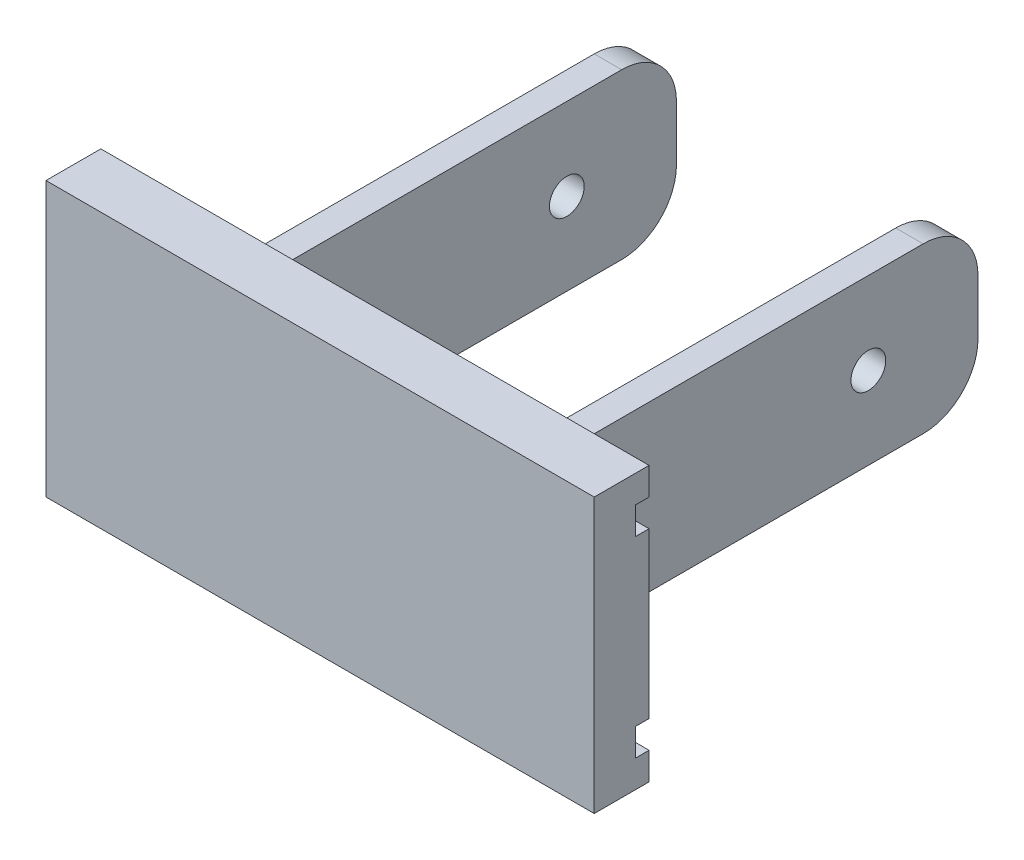
ISO-10303-21;
HEADER;
FILE_DESCRIPTION(('STEP AP214'),'2;1');
FILE_NAME('part.step','',(''),(''),'','','');
FILE_SCHEMA(('AUTOMOTIVE_DESIGN { 1 0 10303 214 1 1 1 1 }'));
ENDSEC;
DATA;
#1=APPLICATION_CONTEXT('core data for automotive mechanical design processes');
#2=APPLICATION_PROTOCOL_DEFINITION('international standard','automotive_design',2000,#1);
#3=PRODUCT_CONTEXT('',#1,'mechanical');
#4=PRODUCT('Part','Part','',(#3));
#5=PRODUCT_RELATED_PRODUCT_CATEGORY('part','',(#4));
#6=PRODUCT_DEFINITION_FORMATION('','',#4);
#7=PRODUCT_DEFINITION_CONTEXT('part definition',#1,'design');
#8=PRODUCT_DEFINITION('design','',#6,#7);
#9=PRODUCT_DEFINITION_SHAPE('','',#8);
#10=(LENGTH_UNIT() NAMED_UNIT(*) SI_UNIT(.MILLI.,.METRE.));
#11=(NAMED_UNIT(*) PLANE_ANGLE_UNIT() SI_UNIT($,.RADIAN.));
#12=(NAMED_UNIT(*) SI_UNIT($,.STERADIAN.) SOLID_ANGLE_UNIT());
#13=UNCERTAINTY_MEASURE_WITH_UNIT(LENGTH_MEASURE(1.E-05),#10,'distance_accuracy_value','');
#14=(GEOMETRIC_REPRESENTATION_CONTEXT(3) GLOBAL_UNCERTAINTY_ASSIGNED_CONTEXT((#13)) GLOBAL_UNIT_ASSIGNED_CONTEXT((#10,
#11,#12)) REPRESENTATION_CONTEXT('',''));
#15=CARTESIAN_POINT('',(0.,0.,0.));
#16=DIRECTION('',(0.,0.,1.));
#17=DIRECTION('',(1.,0.,0.));
#18=AXIS2_PLACEMENT_3D('',#15,#16,#17);
#19=CARTESIAN_POINT('',(0.,0.,0.));
#20=DIRECTION('',(0.,0.,-1.));
#21=DIRECTION('',(-1.,0.,0.));
#22=AXIS2_PLACEMENT_3D('',#19,#20,#21);
#23=PLANE('',#22);
#24=DIRECTION('',(-1.,0.,0.));
#25=VECTOR('',#24,1.);
#26=CARTESIAN_POINT('',(100.,40.,0.));
#27=LINE('',#26,#25);
#28=CARTESIAN_POINT('',(10.,40.,0.));
#29=VERTEX_POINT('',#28);
#30=CARTESIAN_POINT('',(0.,40.,0.));
#31=VERTEX_POINT('',#30);
#32=EDGE_CURVE('E482',#29,#31,#27,.T.);
#33=ORIENTED_EDGE('',*,*,#32,.F.);
#34=DIRECTION('',(0.,1.,0.));
#35=VECTOR('',#34,1.);
#36=CARTESIAN_POINT('',(9.99999999999999,0.,0.));
#37=LINE('',#36,#35);
#38=CARTESIAN_POINT('',(9.99999999999999,10.,0.));
#39=VERTEX_POINT('',#38);
#40=EDGE_CURVE('E62',#29,#39,#37,.F.);
#41=ORIENTED_EDGE('',*,*,#40,.T.);
#42=DIRECTION('',(-1.,0.,0.));
#43=VECTOR('',#42,1.);
#44=CARTESIAN_POINT('',(100.,10.,0.));
#45=LINE('',#44,#43);
#46=CARTESIAN_POINT('',(0.,10.,0.));
#47=VERTEX_POINT('',#46);
#48=EDGE_CURVE('E265',#39,#47,#45,.T.);
#49=ORIENTED_EDGE('',*,*,#48,.T.);
#50=DIRECTION('',(0.,-1.,0.));
#51=VECTOR('',#50,1.);
#52=CARTESIAN_POINT('',(0.,0.,0.));
#53=LINE('',#52,#51);
#54=EDGE_CURVE('E327',#31,#47,#53,.T.);
#55=ORIENTED_EDGE('',*,*,#54,.F.);
#56=EDGE_LOOP('',(#33,#41,#49,#55));
#57=FACE_BOUND('',#56,.T.);
#58=ADVANCED_FACE('F47',(#57),#23,.T.);
#59=CARTESIAN_POINT('',(75.,10.,0.));
#60=VERTEX_POINT('',#59);
#61=CARTESIAN_POINT('',(25.,10.,0.));
#62=VERTEX_POINT('',#61);
#63=EDGE_CURVE('E241',#60,#62,#45,.T.);
#64=ORIENTED_EDGE('',*,*,#63,.T.);
#65=DIRECTION('',(0.,-1.,0.));
#66=VECTOR('',#65,1.);
#67=CARTESIAN_POINT('',(25.,10.,0.));
#68=LINE('',#67,#66);
#69=CARTESIAN_POINT('',(25.,40.,0.));
#70=VERTEX_POINT('',#69);
#71=EDGE_CURVE('E251',#70,#62,#68,.T.);
#72=ORIENTED_EDGE('',*,*,#71,.F.);
#73=CARTESIAN_POINT('',(75.,40.,0.));
#74=VERTEX_POINT('',#73);
#75=EDGE_CURVE('E481',#74,#70,#27,.T.);
#76=ORIENTED_EDGE('',*,*,#75,.F.);
#77=DIRECTION('',(0.,1.,0.));
#78=VECTOR('',#77,1.);
#79=CARTESIAN_POINT('',(75.,10.,0.));
#80=LINE('',#79,#78);
#81=EDGE_CURVE('E257',#60,#74,#80,.T.);
#82=ORIENTED_EDGE('',*,*,#81,.F.);
#83=EDGE_LOOP('',(#64,#72,#76,#82));
#84=FACE_BOUND('',#83,.T.);
#85=ADVANCED_FACE('F261',(#84),#23,.T.);
#86=CARTESIAN_POINT('',(100.,10.,0.));
#87=VERTEX_POINT('',#86);
#88=CARTESIAN_POINT('',(90.,10.,0.));
#89=VERTEX_POINT('',#88);
#90=EDGE_CURVE('E264',#87,#89,#45,.T.);
#91=ORIENTED_EDGE('',*,*,#90,.T.);
#92=DIRECTION('',(0.,-1.,0.));
#93=VECTOR('',#92,1.);
#94=CARTESIAN_POINT('',(90.,0.,0.));
#95=LINE('',#94,#93);
#96=CARTESIAN_POINT('',(90.,40.,0.));
#97=VERTEX_POINT('',#96);
#98=EDGE_CURVE('E396',#89,#97,#95,.F.);
#99=ORIENTED_EDGE('',*,*,#98,.T.);
#100=CARTESIAN_POINT('',(100.,40.,0.));
#101=VERTEX_POINT('',#100);
#102=EDGE_CURVE('E416',#101,#97,#27,.T.);
#103=ORIENTED_EDGE('',*,*,#102,.F.);
#104=DIRECTION('',(0.,1.,0.));
#105=VECTOR('',#104,1.);
#106=CARTESIAN_POINT('',(100.,0.,0.));
#107=LINE('',#106,#105);
#108=EDGE_CURVE('E334',#87,#101,#107,.T.);
#109=ORIENTED_EDGE('',*,*,#108,.F.);
#110=EDGE_LOOP('',(#91,#99,#103,#109));
#111=FACE_BOUND('',#110,.T.);
#112=ADVANCED_FACE('F432',(#111),#23,.T.);
#113=DIRECTION('',(-1.,0.,0.));
#114=VECTOR('',#113,1.);
#115=CARTESIAN_POINT('',(100.,45.,0.));
#116=LINE('',#115,#114);
#117=CARTESIAN_POINT('',(100.,45.,0.));
#118=VERTEX_POINT('',#117);
#119=CARTESIAN_POINT('',(0.,45.,0.));
#120=VERTEX_POINT('',#119);
#121=EDGE_CURVE('E294',#118,#120,#116,.T.);
#122=ORIENTED_EDGE('',*,*,#121,.T.);
#123=CARTESIAN_POINT('',(0.,50.,0.));
#124=VERTEX_POINT('',#123);
#125=EDGE_CURVE('E323',#124,#120,#53,.T.);
#126=ORIENTED_EDGE('',*,*,#125,.F.);
#127=DIRECTION('',(-1.,0.,0.));
#128=VECTOR('',#127,1.);
#129=CARTESIAN_POINT('',(0.,50.,0.));
#130=LINE('',#129,#128);
#131=CARTESIAN_POINT('',(100.,50.,0.));
#132=VERTEX_POINT('',#131);
#133=EDGE_CURVE('E314',#132,#124,#130,.T.);
#134=ORIENTED_EDGE('',*,*,#133,.F.);
#135=EDGE_CURVE('E329',#118,#132,#107,.T.);
#136=ORIENTED_EDGE('',*,*,#135,.F.);
#137=EDGE_LOOP('',(#122,#126,#134,#136));
#138=FACE_BOUND('',#137,.T.);
#139=ADVANCED_FACE('F456',(#138),#23,.T.);
#140=CARTESIAN_POINT('',(0.,0.,10.));
#141=DIRECTION('',(1.,0.,0.));
#142=DIRECTION('',(0.,0.,-1.));
#143=AXIS2_PLACEMENT_3D('',#140,#141,#142);
#144=PLANE('',#143);
#145=ORIENTED_EDGE('',*,*,#125,.T.);
#146=DIRECTION('',(0.,0.,1.));
#147=VECTOR('',#146,1.);
#148=CARTESIAN_POINT('',(0.,45.,10.));
#149=LINE('',#148,#147);
#150=CARTESIAN_POINT('',(0.,45.,2.5));
#151=VERTEX_POINT('',#150);
#152=EDGE_CURVE('E300',#120,#151,#149,.T.);
#153=ORIENTED_EDGE('',*,*,#152,.T.);
#154=DIRECTION('',(0.,-1.,0.));
#155=VECTOR('',#154,1.);
#156=CARTESIAN_POINT('',(0.,0.,2.5));
#157=LINE('',#156,#155);
#158=CARTESIAN_POINT('',(0.,40.,2.5));
#159=VERTEX_POINT('',#158);
#160=EDGE_CURVE('E306',#151,#159,#157,.T.);
#161=ORIENTED_EDGE('',*,*,#160,.T.);
#162=DIRECTION('',(0.,0.,-1.));
#163=VECTOR('',#162,1.);
#164=CARTESIAN_POINT('',(0.,40.,10.));
#165=LINE('',#164,#163);
#166=EDGE_CURVE('E297',#159,#31,#165,.T.);
#167=ORIENTED_EDGE('',*,*,#166,.T.);
#168=ORIENTED_EDGE('',*,*,#54,.T.);
#169=DIRECTION('',(0.,0.,1.));
#170=VECTOR('',#169,1.);
#171=CARTESIAN_POINT('',(0.,9.99999999999999,10.));
#172=LINE('',#171,#170);
#173=CARTESIAN_POINT('',(0.,10.,2.5));
#174=VERTEX_POINT('',#173);
#175=EDGE_CURVE('E293',#47,#174,#172,.T.);
#176=ORIENTED_EDGE('',*,*,#175,.T.);
#177=DIRECTION('',(0.,-1.,0.));
#178=VECTOR('',#177,1.);
#179=CARTESIAN_POINT('',(0.,0.,2.5));
#180=LINE('',#179,#178);
#181=CARTESIAN_POINT('',(0.,5.,2.5));
#182=VERTEX_POINT('',#181);
#183=EDGE_CURVE('E303',#174,#182,#180,.T.);
#184=ORIENTED_EDGE('',*,*,#183,.T.);
#185=DIRECTION('',(0.,0.,-1.));
#186=VECTOR('',#185,1.);
#187=CARTESIAN_POINT('',(0.,5.,10.));
#188=LINE('',#187,#186);
#189=CARTESIAN_POINT('',(0.,5.,0.));
#190=VERTEX_POINT('',#189);
#191=EDGE_CURVE('E290',#182,#190,#188,.T.);
#192=ORIENTED_EDGE('',*,*,#191,.T.);
#193=CARTESIAN_POINT('',(0.,0.,0.));
#194=VERTEX_POINT('',#193);
#195=EDGE_CURVE('E309',#190,#194,#53,.T.);
#196=ORIENTED_EDGE('',*,*,#195,.T.);
#197=DIRECTION('',(0.,0.,-1.));
#198=VECTOR('',#197,1.);
#199=CARTESIAN_POINT('',(0.,0.,10.));
#200=LINE('',#199,#198);
#201=CARTESIAN_POINT('',(0.,0.,10.));
#202=VERTEX_POINT('',#201);
#203=EDGE_CURVE('E347',#202,#194,#200,.T.);
#204=ORIENTED_EDGE('',*,*,#203,.F.);
#205=DIRECTION('',(0.,-1.,0.));
#206=VECTOR('',#205,1.);
#207=CARTESIAN_POINT('',(0.,0.,10.));
#208=LINE('',#207,#206);
#209=CARTESIAN_POINT('',(0.,50.,10.));
#210=VERTEX_POINT('',#209);
#211=EDGE_CURVE('E310',#210,#202,#208,.T.);
#212=ORIENTED_EDGE('',*,*,#211,.F.);
#213=DIRECTION('',(0.,0.,-1.));
#214=VECTOR('',#213,1.);
#215=CARTESIAN_POINT('',(0.,50.,10.));
#216=LINE('',#215,#214);
#217=EDGE_CURVE('E322',#210,#124,#216,.T.);
#218=ORIENTED_EDGE('',*,*,#217,.T.);
#219=EDGE_LOOP('',(#145,#153,#161,#167,#168,#176,#184,#192,#196,#204,#212,#218));
#220=FACE_BOUND('',#219,.T.);
#221=ADVANCED_FACE('F458',(#220),#144,.F.);
#222=CARTESIAN_POINT('',(0.,0.,10.));
#223=DIRECTION('',(0.,1.,0.));
#224=DIRECTION('',(0.,0.,1.));
#225=AXIS2_PLACEMENT_3D('',#222,#223,#224);
#226=PLANE('',#225);
#227=DIRECTION('',(1.,0.,0.));
#228=VECTOR('',#227,1.);
#229=CARTESIAN_POINT('',(0.,0.,0.));
#230=LINE('',#229,#228);
#231=CARTESIAN_POINT('',(100.,0.,0.));
#232=VERTEX_POINT('',#231);
#233=EDGE_CURVE('E326',#194,#232,#230,.T.);
#234=ORIENTED_EDGE('',*,*,#233,.T.);
#235=DIRECTION('',(0.,0.,-1.));
#236=VECTOR('',#235,1.);
#237=CARTESIAN_POINT('',(100.,0.,10.));
#238=LINE('',#237,#236);
#239=CARTESIAN_POINT('',(100.,0.,10.));
#240=VERTEX_POINT('',#239);
#241=EDGE_CURVE('E343',#240,#232,#238,.T.);
#242=ORIENTED_EDGE('',*,*,#241,.F.);
#243=DIRECTION('',(1.,0.,0.));
#244=VECTOR('',#243,1.);
#245=CARTESIAN_POINT('',(0.,0.,10.));
#246=LINE('',#245,#244);
#247=EDGE_CURVE('E313',#202,#240,#246,.T.);
#248=ORIENTED_EDGE('',*,*,#247,.F.);
#249=ORIENTED_EDGE('',*,*,#203,.T.);
#250=EDGE_LOOP('',(#234,#242,#248,#249));
#251=FACE_BOUND('',#250,.T.);
#252=ADVANCED_FACE('F575',(#251),#226,.F.);
#253=CARTESIAN_POINT('',(100.,0.,10.));
#254=DIRECTION('',(-1.,0.,0.));
#255=DIRECTION('',(0.,0.,1.));
#256=AXIS2_PLACEMENT_3D('',#253,#254,#255);
#257=PLANE('',#256);
#258=DIRECTION('',(0.,1.,0.));
#259=VECTOR('',#258,1.);
#260=CARTESIAN_POINT('',(100.,45.,2.5));
#261=LINE('',#260,#259);
#262=CARTESIAN_POINT('',(100.,40.,2.5));
#263=VERTEX_POINT('',#262);
#264=CARTESIAN_POINT('',(100.,45.,2.5));
#265=VERTEX_POINT('',#264);
#266=EDGE_CURVE('E494',#263,#265,#261,.T.);
#267=ORIENTED_EDGE('',*,*,#266,.T.);
#268=DIRECTION('',(0.,0.,-1.));
#269=VECTOR('',#268,1.);
#270=CARTESIAN_POINT('',(100.,45.,0.));
#271=LINE('',#270,#269);
#272=EDGE_CURVE('E448',#265,#118,#271,.T.);
#273=ORIENTED_EDGE('',*,*,#272,.T.);
#274=ORIENTED_EDGE('',*,*,#135,.T.);
#275=DIRECTION('',(0.,0.,-1.));
#276=VECTOR('',#275,1.);
#277=CARTESIAN_POINT('',(100.,50.,10.));
#278=LINE('',#277,#276);
#279=CARTESIAN_POINT('',(100.,50.,10.));
#280=VERTEX_POINT('',#279);
#281=EDGE_CURVE('E339',#280,#132,#278,.T.);
#282=ORIENTED_EDGE('',*,*,#281,.F.);
#283=DIRECTION('',(0.,1.,0.));
#284=VECTOR('',#283,1.);
#285=CARTESIAN_POINT('',(100.,0.,10.));
#286=LINE('',#285,#284);
#287=EDGE_CURVE('E316',#240,#280,#286,.T.);
#288=ORIENTED_EDGE('',*,*,#287,.F.);
#289=ORIENTED_EDGE('',*,*,#241,.T.);
#290=CARTESIAN_POINT('',(100.,5.,0.));
#291=VERTEX_POINT('',#290);
#292=EDGE_CURVE('E330',#232,#291,#107,.T.);
#293=ORIENTED_EDGE('',*,*,#292,.T.);
#294=DIRECTION('',(0.,0.,1.));
#295=VECTOR('',#294,1.);
#296=CARTESIAN_POINT('',(100.,5.,0.));
#297=LINE('',#296,#295);
#298=CARTESIAN_POINT('',(100.,5.,2.5));
#299=VERTEX_POINT('',#298);
#300=EDGE_CURVE('E285',#291,#299,#297,.T.);
#301=ORIENTED_EDGE('',*,*,#300,.T.);
#302=DIRECTION('',(0.,1.,0.));
#303=VECTOR('',#302,1.);
#304=CARTESIAN_POINT('',(100.,10.,2.5));
#305=LINE('',#304,#303);
#306=CARTESIAN_POINT('',(100.,10.,2.5));
#307=VERTEX_POINT('',#306);
#308=EDGE_CURVE('E280',#299,#307,#305,.T.);
#309=ORIENTED_EDGE('',*,*,#308,.T.);
#310=DIRECTION('',(0.,0.,-1.));
#311=VECTOR('',#310,1.);
#312=CARTESIAN_POINT('',(100.,10.,0.));
#313=LINE('',#312,#311);
#314=EDGE_CURVE('E276',#307,#87,#313,.T.);
#315=ORIENTED_EDGE('',*,*,#314,.T.);
#316=ORIENTED_EDGE('',*,*,#108,.T.);
#317=DIRECTION('',(0.,0.,1.));
#318=VECTOR('',#317,1.);
#319=CARTESIAN_POINT('',(100.,40.,0.));
#320=LINE('',#319,#318);
#321=EDGE_CURVE('E289',#101,#263,#320,.T.);
#322=ORIENTED_EDGE('',*,*,#321,.T.);
#323=EDGE_LOOP('',(#267,#273,#274,#282,#288,#289,#293,#301,#309,#315,#316,#322));
#324=FACE_BOUND('',#323,.T.);
#325=ADVANCED_FACE('F444',(#324),#257,.F.);
#326=CARTESIAN_POINT('',(0.,50.,10.));
#327=DIRECTION('',(0.,-1.,0.));
#328=DIRECTION('',(0.,0.,-1.));
#329=AXIS2_PLACEMENT_3D('',#326,#327,#328);
#330=PLANE('',#329);
#331=ORIENTED_EDGE('',*,*,#133,.T.);
#332=ORIENTED_EDGE('',*,*,#217,.F.);
#333=DIRECTION('',(-1.,0.,0.));
#334=VECTOR('',#333,1.);
#335=CARTESIAN_POINT('',(0.,50.,10.));
#336=LINE('',#335,#334);
#337=EDGE_CURVE('E319',#280,#210,#336,.T.);
#338=ORIENTED_EDGE('',*,*,#337,.F.);
#339=ORIENTED_EDGE('',*,*,#281,.T.);
#340=EDGE_LOOP('',(#331,#332,#338,#339));
#341=FACE_BOUND('',#340,.T.);
#342=ADVANCED_FACE('F453',(#341),#330,.F.);
#343=CARTESIAN_POINT('',(0.,0.,10.));
#344=DIRECTION('',(0.,0.,-1.));
#345=DIRECTION('',(-1.,0.,0.));
#346=AXIS2_PLACEMENT_3D('',#343,#344,#345);
#347=PLANE('',#346);
#348=ORIENTED_EDGE('',*,*,#211,.T.);
#349=ORIENTED_EDGE('',*,*,#247,.T.);
#350=ORIENTED_EDGE('',*,*,#287,.T.);
#351=ORIENTED_EDGE('',*,*,#337,.T.);
#352=EDGE_LOOP('',(#348,#349,#350,#351));
#353=FACE_BOUND('',#352,.T.);
#354=ADVANCED_FACE('F462',(#353),#347,.F.);
#355=DIRECTION('',(-1.,0.,0.));
#356=VECTOR('',#355,1.);
#357=CARTESIAN_POINT('',(100.,5.,0.));
#358=LINE('',#357,#356);
#359=EDGE_CURVE('E281',#291,#190,#358,.T.);
#360=ORIENTED_EDGE('',*,*,#359,.F.);
#361=ORIENTED_EDGE('',*,*,#292,.F.);
#362=ORIENTED_EDGE('',*,*,#233,.F.);
#363=ORIENTED_EDGE('',*,*,#195,.F.);
#364=EDGE_LOOP('',(#360,#361,#362,#363));
#365=FACE_BOUND('',#364,.T.);
#366=ADVANCED_FACE('F469',(#365),#23,.T.);
#367=CARTESIAN_POINT('',(100.,10.,2.5));
#368=DIRECTION('',(0.,0.,1.));
#369=DIRECTION('',(0.,-1.,0.));
#370=AXIS2_PLACEMENT_3D('',#367,#368,#369);
#371=PLANE('',#370);
#372=DIRECTION('',(-1.,0.,0.));
#373=VECTOR('',#372,1.);
#374=CARTESIAN_POINT('',(100.,10.,2.5));
#375=LINE('',#374,#373);
#376=EDGE_CURVE('E271',#307,#174,#375,.T.);
#377=ORIENTED_EDGE('',*,*,#376,.F.);
#378=ORIENTED_EDGE('',*,*,#308,.F.);
#379=DIRECTION('',(-1.,0.,0.));
#380=VECTOR('',#379,1.);
#381=CARTESIAN_POINT('',(100.,5.,2.5));
#382=LINE('',#381,#380);
#383=EDGE_CURVE('E473',#299,#182,#382,.T.);
#384=ORIENTED_EDGE('',*,*,#383,.T.);
#385=ORIENTED_EDGE('',*,*,#183,.F.);
#386=EDGE_LOOP('',(#377,#378,#384,#385));
#387=FACE_BOUND('',#386,.T.);
#388=ADVANCED_FACE('F563',(#387),#371,.F.);
#389=CARTESIAN_POINT('',(100.,10.,0.));
#390=DIRECTION('',(0.,1.,0.));
#391=DIRECTION('',(0.,0.,1.));
#392=AXIS2_PLACEMENT_3D('',#389,#390,#391);
#393=PLANE('',#392);
#394=DIRECTION('',(0.,0.,1.));
#395=VECTOR('',#394,1.);
#396=CARTESIAN_POINT('',(20.,10.,-80.));
#397=LINE('',#396,#395);
#398=CARTESIAN_POINT('',(20.,10.,-70.));
#399=VERTEX_POINT('',#398);
#400=CARTESIAN_POINT('',(20.,10.,-9.99999999999999));
#401=VERTEX_POINT('',#400);
#402=EDGE_CURVE('E520',#399,#401,#397,.T.);
#403=ORIENTED_EDGE('',*,*,#402,.F.);
#404=DIRECTION('',(-1.,0.,0.));
#405=VECTOR('',#404,1.);
#406=CARTESIAN_POINT('',(100.,10.,-70.));
#407=LINE('',#406,#405);
#408=CARTESIAN_POINT('',(25.,10.,-70.));
#409=VERTEX_POINT('',#408);
#410=EDGE_CURVE('E243',#399,#409,#407,.F.);
#411=ORIENTED_EDGE('',*,*,#410,.T.);
#412=DIRECTION('',(0.,0.,1.));
#413=VECTOR('',#412,1.);
#414=CARTESIAN_POINT('',(25.,10.,-80.));
#415=LINE('',#414,#413);
#416=EDGE_CURVE('E235',#409,#62,#415,.T.);
#417=ORIENTED_EDGE('',*,*,#416,.T.);
#418=ORIENTED_EDGE('',*,*,#63,.F.);
#419=DIRECTION('',(0.,0.,1.));
#420=VECTOR('',#419,1.);
#421=CARTESIAN_POINT('',(75.,10.,-80.));
#422=LINE('',#421,#420);
#423=CARTESIAN_POINT('',(75.,10.,-70.));
#424=VERTEX_POINT('',#423);
#425=EDGE_CURVE('E498',#424,#60,#422,.T.);
#426=ORIENTED_EDGE('',*,*,#425,.F.);
#427=DIRECTION('',(-1.,0.,0.));
#428=VECTOR('',#427,1.);
#429=CARTESIAN_POINT('',(80.,10.,-70.));
#430=LINE('',#429,#428);
#431=CARTESIAN_POINT('',(80.,10.,-70.));
#432=VERTEX_POINT('',#431);
#433=EDGE_CURVE('E366',#424,#432,#430,.F.);
#434=ORIENTED_EDGE('',*,*,#433,.T.);
#435=DIRECTION('',(0.,0.,1.));
#436=VECTOR('',#435,1.);
#437=CARTESIAN_POINT('',(80.,10.,-80.));
#438=LINE('',#437,#436);
#439=CARTESIAN_POINT('',(80.,10.,-9.99999999999999));
#440=VERTEX_POINT('',#439);
#441=EDGE_CURVE('E426',#432,#440,#438,.T.);
#442=ORIENTED_EDGE('',*,*,#441,.T.);
#443=CARTESIAN_POINT('',(90.,10.,-9.99999999999999));
#444=DIRECTION('',(0.,1.,0.));
#445=DIRECTION('',(0.,0.,1.));
#446=AXIS2_PLACEMENT_3D('',#443,#444,#445);
#447=CIRCLE('',#446,10.);
#448=EDGE_CURVE('E403',#440,#89,#447,.T.);
#449=ORIENTED_EDGE('',*,*,#448,.T.);
#450=ORIENTED_EDGE('',*,*,#90,.F.);
#451=ORIENTED_EDGE('',*,*,#314,.F.);
#452=ORIENTED_EDGE('',*,*,#376,.T.);
#453=ORIENTED_EDGE('',*,*,#175,.F.);
#454=ORIENTED_EDGE('',*,*,#48,.F.);
#455=CARTESIAN_POINT('',(10.,10.,-9.99999999999999));
#456=DIRECTION('',(0.,1.,0.));
#457=DIRECTION('',(0.,0.,1.));
#458=AXIS2_PLACEMENT_3D('',#455,#456,#457);
#459=CIRCLE('',#458,10.);
#460=EDGE_CURVE('E11',#39,#401,#459,.T.);
#461=ORIENTED_EDGE('',*,*,#460,.T.);
#462=EDGE_LOOP('',(#403,#411,#417,#418,#426,#434,#442,#449,#450,#451,#452,#453,#454,#461));
#463=FACE_BOUND('',#462,.T.);
#464=ADVANCED_FACE('F238',(#463),#393,.F.);
#465=CARTESIAN_POINT('',(100.,5.,0.));
#466=DIRECTION('',(0.,-1.,0.));
#467=DIRECTION('',(0.,0.,-1.));
#468=AXIS2_PLACEMENT_3D('',#465,#466,#467);
#469=PLANE('',#468);
#470=ORIENTED_EDGE('',*,*,#383,.F.);
#471=ORIENTED_EDGE('',*,*,#300,.F.);
#472=ORIENTED_EDGE('',*,*,#359,.T.);
#473=ORIENTED_EDGE('',*,*,#191,.F.);
#474=EDGE_LOOP('',(#470,#471,#472,#473));
#475=FACE_BOUND('',#474,.T.);
#476=ADVANCED_FACE('F588',(#475),#469,.F.);
#477=CARTESIAN_POINT('',(100.,45.,2.5));
#478=DIRECTION('',(0.,0.,1.));
#479=DIRECTION('',(0.,-1.,0.));
#480=AXIS2_PLACEMENT_3D('',#477,#478,#479);
#481=PLANE('',#480);
#482=DIRECTION('',(-1.,0.,0.));
#483=VECTOR('',#482,1.);
#484=CARTESIAN_POINT('',(100.,45.,2.5));
#485=LINE('',#484,#483);
#486=EDGE_CURVE('E486',#265,#151,#485,.T.);
#487=ORIENTED_EDGE('',*,*,#486,.F.);
#488=ORIENTED_EDGE('',*,*,#266,.F.);
#489=DIRECTION('',(-1.,0.,0.));
#490=VECTOR('',#489,1.);
#491=CARTESIAN_POINT('',(100.,40.,2.5));
#492=LINE('',#491,#490);
#493=EDGE_CURVE('E480',#263,#159,#492,.T.);
#494=ORIENTED_EDGE('',*,*,#493,.T.);
#495=ORIENTED_EDGE('',*,*,#160,.F.);
#496=EDGE_LOOP('',(#487,#488,#494,#495));
#497=FACE_BOUND('',#496,.T.);
#498=ADVANCED_FACE('F726',(#497),#481,.F.);
#499=CARTESIAN_POINT('',(100.,45.,0.));
#500=DIRECTION('',(0.,1.,0.));
#501=DIRECTION('',(0.,0.,1.));
#502=AXIS2_PLACEMENT_3D('',#499,#500,#501);
#503=PLANE('',#502);
#504=ORIENTED_EDGE('',*,*,#121,.F.);
#505=ORIENTED_EDGE('',*,*,#272,.F.);
#506=ORIENTED_EDGE('',*,*,#486,.T.);
#507=ORIENTED_EDGE('',*,*,#152,.F.);
#508=EDGE_LOOP('',(#504,#505,#506,#507));
#509=FACE_BOUND('',#508,.T.);
#510=ADVANCED_FACE('F597',(#509),#503,.F.);
#511=CARTESIAN_POINT('',(100.,40.,0.));
#512=DIRECTION('',(0.,-1.,0.));
#513=DIRECTION('',(0.,0.,-1.));
#514=AXIS2_PLACEMENT_3D('',#511,#512,#513);
#515=PLANE('',#514);
#516=DIRECTION('',(0.,0.,1.));
#517=VECTOR('',#516,1.);
#518=CARTESIAN_POINT('',(80.,40.,-80.));
#519=LINE('',#518,#517);
#520=CARTESIAN_POINT('',(80.,40.,-70.));
#521=VERTEX_POINT('',#520);
#522=CARTESIAN_POINT('',(80.,40.,-9.99999999999999));
#523=VERTEX_POINT('',#522);
#524=EDGE_CURVE('E272',#521,#523,#519,.T.);
#525=ORIENTED_EDGE('',*,*,#524,.F.);
#526=DIRECTION('',(1.,0.,0.));
#527=VECTOR('',#526,1.);
#528=CARTESIAN_POINT('',(75.,40.,-70.));
#529=LINE('',#528,#527);
#530=CARTESIAN_POINT('',(75.,40.,-70.));
#531=VERTEX_POINT('',#530);
#532=EDGE_CURVE('E390',#521,#531,#529,.F.);
#533=ORIENTED_EDGE('',*,*,#532,.T.);
#534=DIRECTION('',(0.,0.,1.));
#535=VECTOR('',#534,1.);
#536=CARTESIAN_POINT('',(75.,40.,-80.));
#537=LINE('',#536,#535);
#538=EDGE_CURVE('E501',#531,#74,#537,.T.);
#539=ORIENTED_EDGE('',*,*,#538,.T.);
#540=ORIENTED_EDGE('',*,*,#75,.T.);
#541=DIRECTION('',(0.,0.,1.));
#542=VECTOR('',#541,1.);
#543=CARTESIAN_POINT('',(25.,40.,-80.));
#544=LINE('',#543,#542);
#545=CARTESIAN_POINT('',(25.,40.,-70.));
#546=VERTEX_POINT('',#545);
#547=EDGE_CURVE('E248',#546,#70,#544,.T.);
#548=ORIENTED_EDGE('',*,*,#547,.F.);
#549=DIRECTION('',(1.,0.,0.));
#550=VECTOR('',#549,1.);
#551=CARTESIAN_POINT('',(100.,40.,-70.));
#552=LINE('',#551,#550);
#553=CARTESIAN_POINT('',(20.,40.,-70.));
#554=VERTEX_POINT('',#553);
#555=EDGE_CURVE('E388',#546,#554,#552,.F.);
#556=ORIENTED_EDGE('',*,*,#555,.T.);
#557=DIRECTION('',(0.,0.,1.));
#558=VECTOR('',#557,1.);
#559=CARTESIAN_POINT('',(20.,40.,-80.));
#560=LINE('',#559,#558);
#561=CARTESIAN_POINT('',(20.,40.,-9.99999999999999));
#562=VERTEX_POINT('',#561);
#563=EDGE_CURVE('E517',#554,#562,#560,.T.);
#564=ORIENTED_EDGE('',*,*,#563,.T.);
#565=CARTESIAN_POINT('',(10.,40.,-9.99999999999999));
#566=DIRECTION('',(0.,-1.,0.));
#567=DIRECTION('',(0.,0.,-1.));
#568=AXIS2_PLACEMENT_3D('',#565,#566,#567);
#569=CIRCLE('',#568,10.);
#570=EDGE_CURVE('E55',#562,#29,#569,.T.);
#571=ORIENTED_EDGE('',*,*,#570,.T.);
#572=ORIENTED_EDGE('',*,*,#32,.T.);
#573=ORIENTED_EDGE('',*,*,#166,.F.);
#574=ORIENTED_EDGE('',*,*,#493,.F.);
#575=ORIENTED_EDGE('',*,*,#321,.F.);
#576=ORIENTED_EDGE('',*,*,#102,.T.);
#577=CARTESIAN_POINT('',(90.,40.,-9.99999999999999));
#578=DIRECTION('',(0.,-1.,0.));
#579=DIRECTION('',(0.,0.,-1.));
#580=AXIS2_PLACEMENT_3D('',#577,#578,#579);
#581=CIRCLE('',#580,10.);
#582=EDGE_CURVE('E406',#97,#523,#581,.T.);
#583=ORIENTED_EDGE('',*,*,#582,.T.);
#584=EDGE_LOOP('',(#525,#533,#539,#540,#548,#556,#564,#571,#572,#573,#574,#575,#576,#583));
#585=FACE_BOUND('',#584,.T.);
#586=ADVANCED_FACE('F413',(#585),#515,.F.);
#587=CARTESIAN_POINT('',(80.,40.,-80.));
#588=DIRECTION('',(-1.,0.,0.));
#589=DIRECTION('',(0.,0.,1.));
#590=AXIS2_PLACEMENT_3D('',#587,#588,#589);
#591=PLANE('',#590);
#592=CARTESIAN_POINT('',(80.,25.,-60.));
#593=DIRECTION('',(-1.,0.,0.));
#594=DIRECTION('',(0.,0.,1.));
#595=AXIS2_PLACEMENT_3D('',#592,#593,#594);
#596=CIRCLE('',#595,3.17320440207425);
#597=CARTESIAN_POINT('',(80.,25.,-56.8267955979258));
#598=VERTEX_POINT('',#597);
#599=EDGE_CURVE('E524',#598,#598,#596,.T.);
#600=ORIENTED_EDGE('',*,*,#599,.T.);
#601=EDGE_LOOP('',(#600));
#602=FACE_BOUND('',#601,.T.);
#603=ORIENTED_EDGE('',*,*,#524,.T.);
#604=DIRECTION('',(0.,-1.,0.));
#605=VECTOR('',#604,1.);
#606=CARTESIAN_POINT('',(80.,40.,-9.99999999999999));
#607=LINE('',#606,#605);
#608=EDGE_CURVE('E392',#523,#440,#607,.T.);
#609=ORIENTED_EDGE('',*,*,#608,.T.);
#610=ORIENTED_EDGE('',*,*,#441,.F.);
#611=CARTESIAN_POINT('',(80.,20.0000000000001,-70.));
#612=DIRECTION('',(-1.,0.,0.));
#613=DIRECTION('',(0.,0.,1.));
#614=AXIS2_PLACEMENT_3D('',#611,#612,#613);
#615=CIRCLE('',#614,10.);
#616=CARTESIAN_POINT('',(80.,20.0000000000001,-80.));
#617=VERTEX_POINT('',#616);
#618=EDGE_CURVE('E386',#432,#617,#615,.F.);
#619=ORIENTED_EDGE('',*,*,#618,.T.);
#620=DIRECTION('',(0.,-1.,0.));
#621=VECTOR('',#620,1.);
#622=CARTESIAN_POINT('',(80.,40.,-80.));
#623=LINE('',#622,#621);
#624=CARTESIAN_POINT('',(80.,30.,-80.));
#625=VERTEX_POINT('',#624);
#626=EDGE_CURVE('E506',#625,#617,#623,.T.);
#627=ORIENTED_EDGE('',*,*,#626,.F.);
#628=CARTESIAN_POINT('',(80.,30.,-70.));
#629=DIRECTION('',(-1.,0.,0.));
#630=DIRECTION('',(0.,0.,1.));
#631=AXIS2_PLACEMENT_3D('',#628,#629,#630);
#632=CIRCLE('',#631,10.);
#633=EDGE_CURVE('E384',#625,#521,#632,.F.);
#634=ORIENTED_EDGE('',*,*,#633,.T.);
#635=EDGE_LOOP('',(#603,#609,#610,#619,#627,#634));
#636=FACE_BOUND('',#635,.T.);
#637=ADVANCED_FACE('F421',(#602,#636),#591,.F.);
#638=CARTESIAN_POINT('',(75.,10.,-80.));
#639=DIRECTION('',(1.,0.,0.));
#640=DIRECTION('',(0.,0.,-1.));
#641=AXIS2_PLACEMENT_3D('',#638,#639,#640);
#642=PLANE('',#641);
#643=CARTESIAN_POINT('',(75.,25.,-60.));
#644=DIRECTION('',(1.,0.,0.));
#645=DIRECTION('',(0.,0.,-1.));
#646=AXIS2_PLACEMENT_3D('',#643,#644,#645);
#647=CIRCLE('',#646,3.17320440207425);
#648=CARTESIAN_POINT('',(75.,25.,-63.1732044020742));
#649=VERTEX_POINT('',#648);
#650=EDGE_CURVE('E527',#649,#649,#647,.T.);
#651=ORIENTED_EDGE('',*,*,#650,.T.);
#652=EDGE_LOOP('',(#651));
#653=FACE_BOUND('',#652,.T.);
#654=DIRECTION('',(0.,1.,0.));
#655=VECTOR('',#654,1.);
#656=CARTESIAN_POINT('',(75.,10.,-80.));
#657=LINE('',#656,#655);
#658=CARTESIAN_POINT('',(75.,20.0000000000001,-80.));
#659=VERTEX_POINT('',#658);
#660=CARTESIAN_POINT('',(75.,30.,-80.));
#661=VERTEX_POINT('',#660);
#662=EDGE_CURVE('E504',#659,#661,#657,.T.);
#663=ORIENTED_EDGE('',*,*,#662,.F.);
#664=CARTESIAN_POINT('',(75.,20.0000000000001,-70.));
#665=DIRECTION('',(1.,0.,0.));
#666=DIRECTION('',(0.,0.,-1.));
#667=AXIS2_PLACEMENT_3D('',#664,#665,#666);
#668=CIRCLE('',#667,10.);
#669=EDGE_CURVE('E382',#659,#424,#668,.F.);
#670=ORIENTED_EDGE('',*,*,#669,.T.);
#671=ORIENTED_EDGE('',*,*,#425,.T.);
#672=ORIENTED_EDGE('',*,*,#81,.T.);
#673=ORIENTED_EDGE('',*,*,#538,.F.);
#674=CARTESIAN_POINT('',(75.,30.,-70.));
#675=DIRECTION('',(1.,0.,0.));
#676=DIRECTION('',(0.,0.,-1.));
#677=AXIS2_PLACEMENT_3D('',#674,#675,#676);
#678=CIRCLE('',#677,10.);
#679=EDGE_CURVE('E380',#531,#661,#678,.F.);
#680=ORIENTED_EDGE('',*,*,#679,.T.);
#681=EDGE_LOOP('',(#663,#670,#671,#672,#673,#680));
#682=FACE_BOUND('',#681,.T.);
#683=ADVANCED_FACE('F604',(#653,#682),#642,.F.);
#684=CARTESIAN_POINT('',(0.,0.,-80.));
#685=DIRECTION('',(0.,0.,-1.));
#686=DIRECTION('',(-1.,0.,0.));
#687=AXIS2_PLACEMENT_3D('',#684,#685,#686);
#688=PLANE('',#687);
#689=ORIENTED_EDGE('',*,*,#626,.T.);
#690=DIRECTION('',(-1.,0.,0.));
#691=VECTOR('',#690,1.);
#692=CARTESIAN_POINT('',(75.,20.0000000000001,-80.));
#693=LINE('',#692,#691);
#694=EDGE_CURVE('E377',#617,#659,#693,.T.);
#695=ORIENTED_EDGE('',*,*,#694,.T.);
#696=ORIENTED_EDGE('',*,*,#662,.T.);
#697=DIRECTION('',(1.,0.,0.));
#698=VECTOR('',#697,1.);
#699=CARTESIAN_POINT('',(80.,30.,-80.));
#700=LINE('',#699,#698);
#701=EDGE_CURVE('E374',#661,#625,#700,.T.);
#702=ORIENTED_EDGE('',*,*,#701,.T.);
#703=EDGE_LOOP('',(#689,#695,#696,#702));
#704=FACE_BOUND('',#703,.T.);
#705=ADVANCED_FACE('F615',(#704),#688,.T.);
#706=CARTESIAN_POINT('',(20.,40.,-80.));
#707=DIRECTION('',(1.,0.,0.));
#708=DIRECTION('',(0.,1.,0.));
#709=AXIS2_PLACEMENT_3D('',#706,#707,#708);
#710=PLANE('',#709);
#711=CARTESIAN_POINT('',(20.,25.,-60.));
#712=DIRECTION('',(1.,0.,0.));
#713=DIRECTION('',(0.,1.,0.));
#714=AXIS2_PLACEMENT_3D('',#711,#712,#713);
#715=CIRCLE('',#714,3.17320440207425);
#716=CARTESIAN_POINT('',(20.,28.1732044020742,-60.));
#717=VERTEX_POINT('',#716);
#718=EDGE_CURVE('E355',#717,#717,#715,.T.);
#719=ORIENTED_EDGE('',*,*,#718,.T.);
#720=EDGE_LOOP('',(#719));
#721=FACE_BOUND('',#720,.T.);
#722=ORIENTED_EDGE('',*,*,#402,.T.);
#723=DIRECTION('',(0.,1.,0.));
#724=VECTOR('',#723,1.);
#725=CARTESIAN_POINT('',(20.,40.,-9.99999999999999));
#726=LINE('',#725,#724);
#727=EDGE_CURVE('E399',#401,#562,#726,.T.);
#728=ORIENTED_EDGE('',*,*,#727,.T.);
#729=ORIENTED_EDGE('',*,*,#563,.F.);
#730=CARTESIAN_POINT('',(20.,30.,-70.));
#731=DIRECTION('',(1.,0.,0.));
#732=DIRECTION('',(0.,1.,0.));
#733=AXIS2_PLACEMENT_3D('',#730,#731,#732);
#734=CIRCLE('',#733,10.);
#735=CARTESIAN_POINT('',(20.,30.,-80.));
#736=VERTEX_POINT('',#735);
#737=EDGE_CURVE('E361',#554,#736,#734,.F.);
#738=ORIENTED_EDGE('',*,*,#737,.T.);
#739=DIRECTION('',(0.,1.,0.));
#740=VECTOR('',#739,1.);
#741=CARTESIAN_POINT('',(20.,40.,-80.));
#742=LINE('',#741,#740);
#743=CARTESIAN_POINT('',(20.,20.0000000000001,-80.));
#744=VERTEX_POINT('',#743);
#745=EDGE_CURVE('E258',#744,#736,#742,.T.);
#746=ORIENTED_EDGE('',*,*,#745,.F.);
#747=CARTESIAN_POINT('',(20.,20.0000000000001,-70.));
#748=DIRECTION('',(1.,0.,0.));
#749=DIRECTION('',(0.,1.,0.));
#750=AXIS2_PLACEMENT_3D('',#747,#748,#749);
#751=CIRCLE('',#750,10.);
#752=EDGE_CURVE('E363',#744,#399,#751,.F.);
#753=ORIENTED_EDGE('',*,*,#752,.T.);
#754=EDGE_LOOP('',(#722,#728,#729,#738,#746,#753));
#755=FACE_BOUND('',#754,.T.);
#756=ADVANCED_FACE('F534',(#721,#755),#710,.F.);
#757=CARTESIAN_POINT('',(25.,10.,-80.));
#758=DIRECTION('',(-1.,0.,0.));
#759=DIRECTION('',(0.,-1.,0.));
#760=AXIS2_PLACEMENT_3D('',#757,#758,#759);
#761=PLANE('',#760);
#762=CARTESIAN_POINT('',(25.,25.,-60.));
#763=DIRECTION('',(-1.,0.,0.));
#764=DIRECTION('',(0.,-1.,0.));
#765=AXIS2_PLACEMENT_3D('',#762,#763,#764);
#766=CIRCLE('',#765,3.17320440207425);
#767=CARTESIAN_POINT('',(25.,21.8267955979258,-60.));
#768=VERTEX_POINT('',#767);
#769=EDGE_CURVE('E351',#768,#768,#766,.T.);
#770=ORIENTED_EDGE('',*,*,#769,.T.);
#771=EDGE_LOOP('',(#770));
#772=FACE_BOUND('',#771,.T.);
#773=ORIENTED_EDGE('',*,*,#416,.F.);
#774=CARTESIAN_POINT('',(25.,20.0000000000001,-70.));
#775=DIRECTION('',(-1.,0.,0.));
#776=DIRECTION('',(0.,-1.,0.));
#777=AXIS2_PLACEMENT_3D('',#774,#775,#776);
#778=CIRCLE('',#777,10.);
#779=CARTESIAN_POINT('',(25.,20.0000000000001,-80.));
#780=VERTEX_POINT('',#779);
#781=EDGE_CURVE('E372',#409,#780,#778,.F.);
#782=ORIENTED_EDGE('',*,*,#781,.T.);
#783=DIRECTION('',(0.,-1.,0.));
#784=VECTOR('',#783,1.);
#785=CARTESIAN_POINT('',(25.,10.,-80.));
#786=LINE('',#785,#784);
#787=CARTESIAN_POINT('',(25.,30.,-80.));
#788=VERTEX_POINT('',#787);
#789=EDGE_CURVE('E247',#788,#780,#786,.T.);
#790=ORIENTED_EDGE('',*,*,#789,.F.);
#791=CARTESIAN_POINT('',(25.,30.,-70.));
#792=DIRECTION('',(-1.,0.,0.));
#793=DIRECTION('',(0.,-1.,0.));
#794=AXIS2_PLACEMENT_3D('',#791,#792,#793);
#795=CIRCLE('',#794,10.);
#796=EDGE_CURVE('E370',#788,#546,#795,.F.);
#797=ORIENTED_EDGE('',*,*,#796,.T.);
#798=ORIENTED_EDGE('',*,*,#547,.T.);
#799=ORIENTED_EDGE('',*,*,#71,.T.);
#800=EDGE_LOOP('',(#773,#782,#790,#797,#798,#799));
#801=FACE_BOUND('',#800,.T.);
#802=ADVANCED_FACE('F252',(#772,#801),#761,.F.);
#803=CARTESIAN_POINT('',(0.,0.,-80.));
#804=DIRECTION('',(0.,0.,1.));
#805=DIRECTION('',(1.,0.,0.));
#806=AXIS2_PLACEMENT_3D('',#803,#804,#805);
#807=PLANE('',#806);
#808=ORIENTED_EDGE('',*,*,#789,.T.);
#809=DIRECTION('',(-1.,0.,0.));
#810=VECTOR('',#809,1.);
#811=CARTESIAN_POINT('',(0.,20.0000000000001,-80.));
#812=LINE('',#811,#810);
#813=EDGE_CURVE('E358',#780,#744,#812,.T.);
#814=ORIENTED_EDGE('',*,*,#813,.T.);
#815=ORIENTED_EDGE('',*,*,#745,.T.);
#816=DIRECTION('',(1.,0.,0.));
#817=VECTOR('',#816,1.);
#818=CARTESIAN_POINT('',(0.,30.,-80.));
#819=LINE('',#818,#817);
#820=EDGE_CURVE('E350',#736,#788,#819,.T.);
#821=ORIENTED_EDGE('',*,*,#820,.T.);
#822=EDGE_LOOP('',(#808,#814,#815,#821));
#823=FACE_BOUND('',#822,.T.);
#824=ADVANCED_FACE('F540',(#823),#807,.F.);
#825=CARTESIAN_POINT('',(0.,25.,-60.));
#826=DIRECTION('',(1.,0.,0.));
#827=DIRECTION('',(0.,0.,-1.));
#828=AXIS2_PLACEMENT_3D('',#825,#826,#827);
#829=CYLINDRICAL_SURFACE('',#828,3.17320440207425);
#830=ORIENTED_EDGE('',*,*,#769,.F.);
#831=EDGE_LOOP('',(#830));
#832=FACE_BOUND('',#831,.T.);
#833=ORIENTED_EDGE('',*,*,#718,.F.);
#834=EDGE_LOOP('',(#833));
#835=FACE_BOUND('',#834,.T.);
#836=ADVANCED_FACE('F537',(#832,#835),#829,.F.);
#837=ORIENTED_EDGE('',*,*,#650,.F.);
#838=EDGE_LOOP('',(#837));
#839=FACE_BOUND('',#838,.T.);
#840=ORIENTED_EDGE('',*,*,#599,.F.);
#841=EDGE_LOOP('',(#840));
#842=FACE_BOUND('',#841,.T.);
#843=ADVANCED_FACE('F539',(#839,#842),#829,.F.);
#844=CARTESIAN_POINT('',(0.,20.0000000000001,-70.));
#845=DIRECTION('',(-1.,0.,0.));
#846=DIRECTION('',(0.,0.,1.));
#847=AXIS2_PLACEMENT_3D('',#844,#845,#846);
#848=CYLINDRICAL_SURFACE('',#847,10.);
#849=ORIENTED_EDGE('',*,*,#781,.F.);
#850=ORIENTED_EDGE('',*,*,#410,.F.);
#851=ORIENTED_EDGE('',*,*,#752,.F.);
#852=ORIENTED_EDGE('',*,*,#813,.F.);
#853=EDGE_LOOP('',(#849,#850,#851,#852));
#854=FACE_BOUND('',#853,.T.);
#855=ADVANCED_FACE('F547',(#854),#848,.T.);
#856=CARTESIAN_POINT('',(0.,20.0000000000001,-70.));
#857=DIRECTION('',(1.,0.,0.));
#858=DIRECTION('',(0.,0.,-1.));
#859=AXIS2_PLACEMENT_3D('',#856,#857,#858);
#860=CYLINDRICAL_SURFACE('',#859,10.);
#861=ORIENTED_EDGE('',*,*,#618,.F.);
#862=ORIENTED_EDGE('',*,*,#433,.F.);
#863=ORIENTED_EDGE('',*,*,#669,.F.);
#864=ORIENTED_EDGE('',*,*,#694,.F.);
#865=EDGE_LOOP('',(#861,#862,#863,#864));
#866=FACE_BOUND('',#865,.T.);
#867=ADVANCED_FACE('F650',(#866),#860,.T.);
#868=CARTESIAN_POINT('',(0.,30.,-70.));
#869=DIRECTION('',(-1.,0.,0.));
#870=DIRECTION('',(0.,0.,1.));
#871=AXIS2_PLACEMENT_3D('',#868,#869,#870);
#872=CYLINDRICAL_SURFACE('',#871,10.);
#873=ORIENTED_EDGE('',*,*,#679,.F.);
#874=ORIENTED_EDGE('',*,*,#532,.F.);
#875=ORIENTED_EDGE('',*,*,#633,.F.);
#876=ORIENTED_EDGE('',*,*,#701,.F.);
#877=EDGE_LOOP('',(#873,#874,#875,#876));
#878=FACE_BOUND('',#877,.T.);
#879=ADVANCED_FACE('F641',(#878),#872,.T.);
#880=CARTESIAN_POINT('',(0.,30.,-70.));
#881=DIRECTION('',(1.,0.,0.));
#882=DIRECTION('',(0.,0.,-1.));
#883=AXIS2_PLACEMENT_3D('',#880,#881,#882);
#884=CYLINDRICAL_SURFACE('',#883,10.);
#885=ORIENTED_EDGE('',*,*,#737,.F.);
#886=ORIENTED_EDGE('',*,*,#555,.F.);
#887=ORIENTED_EDGE('',*,*,#796,.F.);
#888=ORIENTED_EDGE('',*,*,#820,.F.);
#889=EDGE_LOOP('',(#885,#886,#887,#888));
#890=FACE_BOUND('',#889,.T.);
#891=ADVANCED_FACE('F625',(#890),#884,.T.);
#892=CARTESIAN_POINT('',(90.,40.,-9.99999999999999));
#893=DIRECTION('',(0.,-1.,0.));
#894=DIRECTION('',(0.,0.,-1.));
#895=AXIS2_PLACEMENT_3D('',#892,#893,#894);
#896=CYLINDRICAL_SURFACE('',#895,10.);
#897=ORIENTED_EDGE('',*,*,#582,.F.);
#898=ORIENTED_EDGE('',*,*,#98,.F.);
#899=ORIENTED_EDGE('',*,*,#448,.F.);
#900=ORIENTED_EDGE('',*,*,#608,.F.);
#901=EDGE_LOOP('',(#897,#898,#899,#900));
#902=FACE_BOUND('',#901,.T.);
#903=ADVANCED_FACE('F428',(#902),#896,.F.);
#904=CARTESIAN_POINT('',(10.,40.,-9.99999999999999));
#905=DIRECTION('',(0.,1.,0.));
#906=DIRECTION('',(-1.,0.,0.));
#907=AXIS2_PLACEMENT_3D('',#904,#905,#906);
#908=CYLINDRICAL_SURFACE('',#907,10.);
#909=ORIENTED_EDGE('',*,*,#460,.F.);
#910=ORIENTED_EDGE('',*,*,#40,.F.);
#911=ORIENTED_EDGE('',*,*,#570,.F.);
#912=ORIENTED_EDGE('',*,*,#727,.F.);
#913=EDGE_LOOP('',(#909,#910,#911,#912));
#914=FACE_BOUND('',#913,.T.);
#915=ADVANCED_FACE('F49',(#914),#908,.F.);
#916=CLOSED_SHELL('',(#58,#85,#112,#139,#221,#252,#325,#342,#354,#366,#388,#464,#476,#498,#510,
#586,#637,#683,#705,#756,#802,#824,#836,#843,#855,#867,#879,#891,#903,#915));
#917=MANIFOLD_SOLID_BREP('B2',#916);
#918=ADVANCED_BREP_SHAPE_REPRESENTATION('',(#18,#917),#14);
#919=SHAPE_DEFINITION_REPRESENTATION(#9,#918);
ENDSEC;
END-ISO-10303-21;
